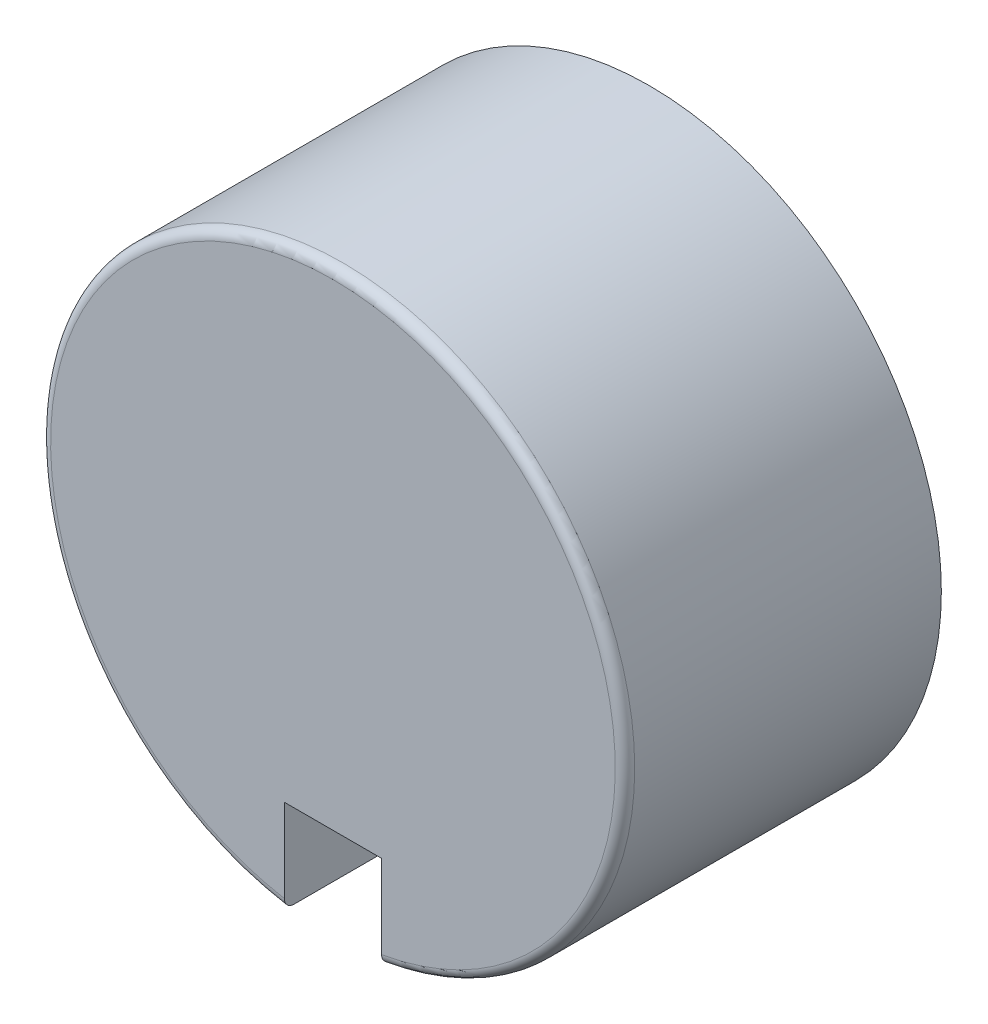
ISO-10303-21;
HEADER;
FILE_DESCRIPTION(('STEP AP214'),'2;1');
FILE_NAME('part.step','',(''),(''),'','','');
FILE_SCHEMA(('AUTOMOTIVE_DESIGN { 1 0 10303 214 1 1 1 1 }'));
ENDSEC;
DATA;
#1=APPLICATION_CONTEXT('core data for automotive mechanical design processes');
#2=APPLICATION_PROTOCOL_DEFINITION('international standard','automotive_design',2000,#1);
#3=PRODUCT_CONTEXT('',#1,'mechanical');
#4=PRODUCT('Part','Part','',(#3));
#5=PRODUCT_RELATED_PRODUCT_CATEGORY('part','',(#4));
#6=PRODUCT_DEFINITION_FORMATION('','',#4);
#7=PRODUCT_DEFINITION_CONTEXT('part definition',#1,'design');
#8=PRODUCT_DEFINITION('design','',#6,#7);
#9=PRODUCT_DEFINITION_SHAPE('','',#8);
#10=(LENGTH_UNIT() NAMED_UNIT(*) SI_UNIT(.MILLI.,.METRE.));
#11=(NAMED_UNIT(*) PLANE_ANGLE_UNIT() SI_UNIT($,.RADIAN.));
#12=(NAMED_UNIT(*) SI_UNIT($,.STERADIAN.) SOLID_ANGLE_UNIT());
#13=UNCERTAINTY_MEASURE_WITH_UNIT(LENGTH_MEASURE(1.E-05),#10,'distance_accuracy_value','');
#14=(GEOMETRIC_REPRESENTATION_CONTEXT(3) GLOBAL_UNCERTAINTY_ASSIGNED_CONTEXT((#13)) GLOBAL_UNIT_ASSIGNED_CONTEXT((#10,
#11,#12)) REPRESENTATION_CONTEXT('',''));
#15=CARTESIAN_POINT('',(0.,0.,0.));
#16=DIRECTION('',(0.,0.,1.));
#17=DIRECTION('',(1.,0.,0.));
#18=AXIS2_PLACEMENT_3D('',#15,#16,#17);
#19=CARTESIAN_POINT('',(0.,0.,-6.5));
#20=DIRECTION('',(0.,0.,1.));
#21=DIRECTION('',(1.,0.,0.));
#22=AXIS2_PLACEMENT_3D('',#19,#20,#21);
#23=CYLINDRICAL_SURFACE('',#22,4.9);
#24=CARTESIAN_POINT('',(0.,0.,-6.5));
#25=DIRECTION('',(0.,0.,1.));
#26=DIRECTION('',(1.,0.,0.));
#27=AXIS2_PLACEMENT_3D('',#24,#25,#26);
#28=CIRCLE('',#27,4.9);
#29=CARTESIAN_POINT('',(4.9,0.,-6.5));
#30=VERTEX_POINT('',#29);
#31=EDGE_CURVE('E135',#30,#30,#28,.T.);
#32=ORIENTED_EDGE('',*,*,#31,.F.);
#33=EDGE_LOOP('',(#32));
#34=FACE_BOUND('',#33,.T.);
#35=DIRECTION('',(0.,0.,1.));
#36=VECTOR('',#35,1.);
#37=CARTESIAN_POINT('',(1.,-4.79687398208458,-6.5));
#38=LINE('',#37,#36);
#39=CARTESIAN_POINT('',(1.,-4.79687398208458,-1.));
#40=VERTEX_POINT('',#39);
#41=CARTESIAN_POINT('',(1.,-4.79687398208458,-2.));
#42=VERTEX_POINT('',#41);
#43=EDGE_CURVE('E131',#40,#42,#38,.F.);
#44=ORIENTED_EDGE('',*,*,#43,.F.);
#45=CARTESIAN_POINT('',(0.,0.,-1.));
#46=DIRECTION('',(0.,0.,1.));
#47=DIRECTION('',(1.,0.,0.));
#48=AXIS2_PLACEMENT_3D('',#45,#46,#47);
#49=CIRCLE('',#48,4.9);
#50=CARTESIAN_POINT('',(-1.,-4.79687398208458,-1.));
#51=VERTEX_POINT('',#50);
#52=EDGE_CURVE('E141',#51,#40,#49,.F.);
#53=ORIENTED_EDGE('',*,*,#52,.F.);
#54=DIRECTION('',(0.,0.,1.));
#55=VECTOR('',#54,1.);
#56=CARTESIAN_POINT('',(-1.,-4.79687398208458,-6.5));
#57=LINE('',#56,#55);
#58=CARTESIAN_POINT('',(-1.,-4.79687398208458,-2.));
#59=VERTEX_POINT('',#58);
#60=EDGE_CURVE('E124',#59,#51,#57,.T.);
#61=ORIENTED_EDGE('',*,*,#60,.F.);
#62=CARTESIAN_POINT('',(0.,0.,-2.));
#63=DIRECTION('',(0.,0.,1.));
#64=DIRECTION('',(1.,0.,0.));
#65=AXIS2_PLACEMENT_3D('',#62,#63,#64);
#66=CIRCLE('',#65,4.9);
#67=EDGE_CURVE('E133',#42,#59,#66,.F.);
#68=ORIENTED_EDGE('',*,*,#67,.F.);
#69=EDGE_LOOP('',(#44,#53,#61,#68));
#70=FACE_BOUND('',#69,.T.);
#71=ADVANCED_FACE('F35',(#34,#70),#23,.F.);
#72=CARTESIAN_POINT('',(0.,0.,-6.5));
#73=DIRECTION('',(0.,0.,1.));
#74=DIRECTION('',(1.,0.,0.));
#75=AXIS2_PLACEMENT_3D('',#72,#73,#74);
#76=CYLINDRICAL_SURFACE('',#75,6.);
#77=CARTESIAN_POINT('',(0.,0.,-6.5));
#78=DIRECTION('',(0.,0.,1.));
#79=DIRECTION('',(1.,0.,0.));
#80=AXIS2_PLACEMENT_3D('',#77,#78,#79);
#81=CIRCLE('',#80,6.);
#82=CARTESIAN_POINT('',(6.,0.,-6.5));
#83=VERTEX_POINT('',#82);
#84=EDGE_CURVE('E138',#83,#83,#81,.T.);
#85=ORIENTED_EDGE('',*,*,#84,.T.);
#86=EDGE_LOOP('',(#85));
#87=FACE_BOUND('',#86,.T.);
#88=CARTESIAN_POINT('',(0.,0.,-0.2));
#89=DIRECTION('',(0.,0.,1.));
#90=DIRECTION('',(1.,0.,0.));
#91=AXIS2_PLACEMENT_3D('',#88,#89,#90);
#92=CIRCLE('',#91,6.);
#93=CARTESIAN_POINT('',(-1.,-5.9160797831018,-0.200000000000269));
#94=VERTEX_POINT('',#93);
#95=CARTESIAN_POINT('',(1.,-5.91607978309985,-0.199999999999976));
#96=VERTEX_POINT('',#95);
#97=EDGE_CURVE('E145',#94,#96,#92,.F.);
#98=ORIENTED_EDGE('',*,*,#97,.T.);
#99=DIRECTION('',(0.,0.,1.));
#100=VECTOR('',#99,1.);
#101=CARTESIAN_POINT('',(1.,-5.91607978309962,-6.5));
#102=LINE('',#101,#100);
#103=CARTESIAN_POINT('',(1.,-5.91607978309962,-2.));
#104=VERTEX_POINT('',#103);
#105=EDGE_CURVE('E126',#96,#104,#102,.F.);
#106=ORIENTED_EDGE('',*,*,#105,.T.);
#107=CARTESIAN_POINT('',(0.,0.,-2.));
#108=DIRECTION('',(0.,0.,1.));
#109=DIRECTION('',(1.,0.,0.));
#110=AXIS2_PLACEMENT_3D('',#107,#108,#109);
#111=CIRCLE('',#110,6.);
#112=CARTESIAN_POINT('',(-1.,-5.91607978309962,-2.));
#113=VERTEX_POINT('',#112);
#114=EDGE_CURVE('E11',#104,#113,#111,.F.);
#115=ORIENTED_EDGE('',*,*,#114,.T.);
#116=DIRECTION('',(0.,0.,1.));
#117=VECTOR('',#116,1.);
#118=CARTESIAN_POINT('',(-1.,-5.91607978309962,-6.5));
#119=LINE('',#118,#117);
#120=EDGE_CURVE('E120',#113,#94,#119,.T.);
#121=ORIENTED_EDGE('',*,*,#120,.T.);
#122=EDGE_LOOP('',(#98,#106,#115,#121));
#123=FACE_BOUND('',#122,.T.);
#124=ADVANCED_FACE('F176',(#87,#123),#76,.T.);
#125=CARTESIAN_POINT('',(0.,0.,0.));
#126=DIRECTION('',(0.,0.,1.));
#127=DIRECTION('',(1.,0.,0.));
#128=AXIS2_PLACEMENT_3D('',#125,#126,#127);
#129=PLANE('',#128);
#130=DIRECTION('',(1.,0.,0.));
#131=VECTOR('',#130,1.);
#132=CARTESIAN_POINT('',(-1.,-4.,0.));
#133=LINE('',#132,#131);
#134=CARTESIAN_POINT('',(-1.,-4.,0.));
#135=VERTEX_POINT('',#134);
#136=CARTESIAN_POINT('',(1.,-4.,0.));
#137=VERTEX_POINT('',#136);
#138=EDGE_CURVE('E96',#135,#137,#133,.T.);
#139=ORIENTED_EDGE('',*,*,#138,.T.);
#140=DIRECTION('',(0.,-1.,0.));
#141=VECTOR('',#140,1.);
#142=CARTESIAN_POINT('',(1.,-4.,0.));
#143=LINE('',#142,#141);
#144=CARTESIAN_POINT('',(1.,-5.71314274283428,0.));
#145=VERTEX_POINT('',#144);
#146=EDGE_CURVE('E105',#137,#145,#143,.T.);
#147=ORIENTED_EDGE('',*,*,#146,.T.);
#148=CARTESIAN_POINT('',(0.,0.,0.));
#149=DIRECTION('',(0.,0.,1.));
#150=DIRECTION('',(1.,0.,0.));
#151=AXIS2_PLACEMENT_3D('',#148,#149,#150);
#152=CIRCLE('',#151,5.8);
#153=CARTESIAN_POINT('',(-1.,-5.71314274283428,0.));
#154=VERTEX_POINT('',#153);
#155=EDGE_CURVE('E110',#145,#154,#152,.T.);
#156=ORIENTED_EDGE('',*,*,#155,.T.);
#157=DIRECTION('',(0.,-1.,0.));
#158=VECTOR('',#157,1.);
#159=CARTESIAN_POINT('',(-1.,-4.,0.));
#160=LINE('',#159,#158);
#161=EDGE_CURVE('E58',#135,#154,#160,.T.);
#162=ORIENTED_EDGE('',*,*,#161,.F.);
#163=EDGE_LOOP('',(#139,#147,#156,#162));
#164=FACE_BOUND('',#163,.T.);
#165=ADVANCED_FACE('F108',(#164),#129,.T.);
#166=CARTESIAN_POINT('',(0.,0.,-1.));
#167=DIRECTION('',(0.,0.,1.));
#168=DIRECTION('',(1.,0.,0.));
#169=AXIS2_PLACEMENT_3D('',#166,#167,#168);
#170=PLANE('',#169);
#171=DIRECTION('',(0.,-1.,0.));
#172=VECTOR('',#171,1.);
#173=CARTESIAN_POINT('',(1.,0.,-1.));
#174=LINE('',#173,#172);
#175=CARTESIAN_POINT('',(1.,-4.,-1.));
#176=VERTEX_POINT('',#175);
#177=EDGE_CURVE('E129',#176,#40,#174,.T.);
#178=ORIENTED_EDGE('',*,*,#177,.F.);
#179=DIRECTION('',(1.,0.,0.));
#180=VECTOR('',#179,1.);
#181=CARTESIAN_POINT('',(0.,-4.,-1.));
#182=LINE('',#181,#180);
#183=CARTESIAN_POINT('',(-1.,-4.,-1.));
#184=VERTEX_POINT('',#183);
#185=EDGE_CURVE('E44',#184,#176,#182,.T.);
#186=ORIENTED_EDGE('',*,*,#185,.F.);
#187=DIRECTION('',(0.,1.,0.));
#188=VECTOR('',#187,1.);
#189=CARTESIAN_POINT('',(-1.,0.,-1.));
#190=LINE('',#189,#188);
#191=EDGE_CURVE('E94',#51,#184,#190,.T.);
#192=ORIENTED_EDGE('',*,*,#191,.F.);
#193=ORIENTED_EDGE('',*,*,#52,.T.);
#194=EDGE_LOOP('',(#178,#186,#192,#193));
#195=FACE_BOUND('',#194,.T.);
#196=ADVANCED_FACE('F170',(#195),#170,.F.);
#197=CARTESIAN_POINT('',(0.,0.,-0.2));
#198=DIRECTION('',(0.,0.,1.));
#199=DIRECTION('',(1.,0.,0.));
#200=AXIS2_PLACEMENT_3D('',#197,#198,#199);
#201=TOROIDAL_SURFACE('',#200,5.8,0.2);
#202=ORIENTED_EDGE('',*,*,#155,.F.);
#203=CARTESIAN_POINT('',(1.,-5.8982449608597,-0.117996134023775));
#204=CARTESIAN_POINT('',(1.,-5.90284940246298,-0.12809564819195));
#205=CARTESIAN_POINT('',(1.,-5.90660825895747,-0.138589034521386));
#206=CARTESIAN_POINT('',(1.,-5.91231453909085,-0.160066001184723));
#207=CARTESIAN_POINT('',(1.,-5.91425999612147,-0.171050100198483));
#208=CARTESIAN_POINT('',(1.,-5.91627488954328,-0.193186837419315));
#209=CARTESIAN_POINT('',(1.,-5.91634488073243,-0.204339424807556));
#210=CARTESIAN_POINT('',(1.,-5.91460761355215,-0.226494538112982));
#211=CARTESIAN_POINT('',(1.,-5.91280077872359,-0.237497097319273));
#212=CARTESIAN_POINT('',(1.,-5.90737048505053,-0.25902566855835));
#213=CARTESIAN_POINT('',(1.,-5.90374988030742,-0.269552401055242));
#214=CARTESIAN_POINT('',(1.,-5.8948028473437,-0.289854070379176));
#215=CARTESIAN_POINT('',(1.,-5.88947633051022,-0.299628968119763));
#216=CARTESIAN_POINT('',(1.,-5.87723904776974,-0.318214463897688));
#217=CARTESIAN_POINT('',(1.,-5.87031901661267,-0.327018958723426));
#218=CARTESIAN_POINT('',(1.,-5.85511550567612,-0.343358868608756));
#219=CARTESIAN_POINT('',(1.,-5.84683194919554,-0.350894212227716));
#220=CARTESIAN_POINT('',(1.,-5.82902848902292,-0.364582449759333));
#221=CARTESIAN_POINT('',(1.,-5.81949459689243,-0.370717146980239));
#222=CARTESIAN_POINT('',(1.,-5.79954326159245,-0.381324296499617));
#223=CARTESIAN_POINT('',(1.,-5.78912575427127,-0.38579662798095));
#224=CARTESIAN_POINT('',(1.,-5.76754828341185,-0.393015594430471));
#225=CARTESIAN_POINT('',(1.,-5.75638003824898,-0.395737483163669));
#226=CARTESIAN_POINT('',(1.,-5.73374638718978,-0.3992876254919));
#227=CARTESIAN_POINT('',(1.,-5.7222809623604,-0.400115758136016));
#228=CARTESIAN_POINT('',(1.,-5.69926056860509,-0.399856960695239));
#229=CARTESIAN_POINT('',(1.,-5.68770580406378,-0.398751461473628));
#230=CARTESIAN_POINT('',(1.,-5.66494482650492,-0.39461872312261));
#231=CARTESIAN_POINT('',(1.,-5.65373862127352,-0.39159144109645));
#232=CARTESIAN_POINT('',(1.,-5.63198386193382,-0.383690415886474));
#233=CARTESIAN_POINT('',(1.,-5.62143597888692,-0.378814823304399));
#234=CARTESIAN_POINT('',(1.,-5.60131816527423,-0.367347087084138));
#235=CARTESIAN_POINT('',(1.,-5.59174820081033,-0.360755002973746));
#236=CARTESIAN_POINT('',(1.,-5.57395099927192,-0.346098468347493));
#237=CARTESIAN_POINT('',(1.,-5.5657127847031,-0.338047353523434));
#238=CARTESIAN_POINT('',(1.,-5.55072994054039,-0.320657851251012));
#239=CARTESIAN_POINT('',(1.,-5.54398518875856,-0.311319569213976));
#240=CARTESIAN_POINT('',(1.,-5.5322888661944,-0.291769794832765));
#241=CARTESIAN_POINT('',(1.,-5.52731202659611,-0.281573421112068));
#242=CARTESIAN_POINT('',(1.,-5.51916912367977,-0.260481584622246));
#243=CARTESIAN_POINT('',(1.,-5.51600290020523,-0.24958618377981));
#244=CARTESIAN_POINT('',(1.,-5.51161382922065,-0.227572016000385));
#245=CARTESIAN_POINT('',(1.,-5.51036402008469,-0.216458618996264));
#246=CARTESIAN_POINT('',(1.,-5.50976166416355,-0.194180788619046));
#247=CARTESIAN_POINT('',(1.,-5.51040902107902,-0.183016357865123));
#248=CARTESIAN_POINT('',(1.,-5.51356981225732,-0.161030558335853));
#249=CARTESIAN_POINT('',(1.,-5.51607092083278,-0.150207413619104));
#250=CARTESIAN_POINT('',(1.,-5.52284746691649,-0.129132046164254));
#251=CARTESIAN_POINT('',(1.,-5.52712291926431,-0.118879828201859));
#252=CARTESIAN_POINT('',(1.,-5.53733948583266,-0.0991886888111274));
#253=CARTESIAN_POINT('',(1.,-5.54328740408271,-0.0897532999413653));
#254=CARTESIAN_POINT('',(1.,-5.55666417968717,-0.0719987645097891));
#255=CARTESIAN_POINT('',(1.,-5.5640931215594,-0.0636796816977534));
#256=CARTESIAN_POINT('',(1.,-5.58032012716,-0.0482790052782423));
#257=CARTESIAN_POINT('',(1.,-5.58913440453007,-0.0412144990421068));
#258=CARTESIAN_POINT('',(1.,-5.60780888445044,-0.0286389316031162));
#259=CARTESIAN_POINT('',(1.,-5.61766917347447,-0.0231279989720658));
#260=CARTESIAN_POINT('',(1.,-5.6383179728061,-0.0137284109082103));
#261=CARTESIAN_POINT('',(1.,-5.64911839242828,-0.00986591134086246));
#262=CARTESIAN_POINT('',(1.,-5.6712105202713,-0.00398649000902977));
#263=CARTESIAN_POINT('',(1.,-5.68250226307756,-0.00196969838927203));
#264=CARTESIAN_POINT('',(1.,-5.70539044516461,0.000178149193995465));
#265=CARTESIAN_POINT('',(1.,-5.71698887452675,0.000288053286869655));
#266=CARTESIAN_POINT('',(1.,-5.74004023306832,-0.00143613443673743));
#267=CARTESIAN_POINT('',(1.,-5.75149316386353,-0.00327020464600208));
#268=CARTESIAN_POINT('',(1.,-5.77395149316123,-0.00884153084814581));
#269=CARTESIAN_POINT('',(1.,-5.78495593933686,-0.0125826298544445));
#270=CARTESIAN_POINT('',(1.,-5.80617667568098,-0.0218738343380537));
#271=CARTESIAN_POINT('',(1.,-5.81639279173221,-0.0274243380494783));
#272=CARTESIAN_POINT('',(1.,-5.8356637965465,-0.0401389835754201));
#273=CARTESIAN_POINT('',(1.,-5.84472621164833,-0.0472917265971989));
#274=CARTESIAN_POINT('',(1.,-5.86149222902899,-0.0630310601201447));
#275=CARTESIAN_POINT('',(1.,-5.86919755910767,-0.0716157999162422));
#276=CARTESIAN_POINT('',(1.,-5.88045706271264,-0.086567152463729));
#277=CARTESIAN_POINT('',(1.,-5.88449188728168,-0.0925781099193626));
#278=CARTESIAN_POINT('',(1.,-5.89188578562603,-0.105002353808573));
#279=CARTESIAN_POINT('',(1.,-5.89524486468477,-0.111415637095976));
#280=CARTESIAN_POINT('',(1.,-5.8982449608597,-0.117996134023775));
#281=B_SPLINE_CURVE_WITH_KNOTS('',3,(#203,#204,#205,#206,#207,#208,#209,#210,#211,#212,#213,
#214,#215,#216,#217,#218,#219,#220,#221,#222,#223,#224,#225,#226,#227,#228,#229,#230,#231,#232,
#233,#234,#235,#236,#237,#238,#239,#240,#241,#242,#243,#244,#245,#246,#247,#248,#249,#250,#251,
#252,#253,#254,#255,#256,#257,#258,#259,#260,#261,#262,#263,#264,#265,#266,#267,#268,#269,#270,
#271,#272,#273,#274,#275,#276,#277,#278,#279,#280),.UNSPECIFIED.,.T.,.F.,(4,2,2,2,2,2,2,2,2,2,2,
2,2,2,2,2,2,2,2,2,2,2,2,2,2,2,2,2,2,2,2,2,2,2,2,2,2,2,4),(0.,0.0332725897718165,
0.0665812213977847,0.0998799995973357,0.133171264937165,0.166410307785302,0.199651077501586,
0.233090231766396,0.266531267695524,0.300384748808202,0.334240689837634,0.368565305821954,
0.402892113998742,0.437550383209348,0.472209426065908,0.506903240288814,0.541595851493114,
0.57598604355215,0.610373420930771,0.64424739342885,0.678118369170345,0.711508301682278,
0.744896539364481,0.778064746348603,0.811233230737557,0.844538655638697,0.877845981730508,
0.911576988372977,0.945310785732334,0.979561557187355,1.01381474354986,1.04844763842694,
1.08308014836446,1.11778272671227,1.15249294795581,1.18696365983532,1.22139016229572,
1.24306960975334,1.26474888769953),.UNSPECIFIED.);
#282=EDGE_CURVE('E153',#145,#96,#281,.T.);
#283=ORIENTED_EDGE('',*,*,#282,.T.);
#284=ORIENTED_EDGE('',*,*,#97,.F.);
#285=CARTESIAN_POINT('',(-1.,-5.8982449608597,-0.117996134023775));
#286=CARTESIAN_POINT('',(-1.,-5.89357112276656,-0.107746889499634));
#287=CARTESIAN_POINT('',(-1.,-5.8880193987563,-0.0978882896056384));
#288=CARTESIAN_POINT('',(-1.,-5.87532877831371,-0.0792395143415351));
#289=CARTESIAN_POINT('',(-1.,-5.86818777128844,-0.0704507840109065));
#290=CARTESIAN_POINT('',(-1.,-5.85254293453124,-0.0542015022902492));
#291=CARTESIAN_POINT('',(-1.,-5.84404055752965,-0.046739552796617));
#292=CARTESIAN_POINT('',(-1.,-5.82591750987947,-0.0333339911290358));
#293=CARTESIAN_POINT('',(-1.,-5.81629710775323,-0.0273900154669147));
#294=CARTESIAN_POINT('',(-1.,-5.79610383975728,-0.01711776036898));
#295=CARTESIAN_POINT('',(-1.,-5.78552215854018,-0.0128068122231284));
#296=CARTESIAN_POINT('',(-1.,-5.76379019887745,-0.00599813839470695));
#297=CARTESIAN_POINT('',(-1.,-5.75263985727142,-0.003500614598395));
#298=CARTESIAN_POINT('',(-1.,-5.72994186735187,-0.000362395286940027));
#299=CARTESIAN_POINT('',(-1.,-5.71839103149766,0.00025527495109669));
#300=CARTESIAN_POINT('',(-1.,-5.69534805627243,-0.000446230275118177));
#301=CARTESIAN_POINT('',(-1.,-5.68385591941737,-0.00176548807192294));
#302=CARTESIAN_POINT('',(-1.,-5.66119422406995,-0.0063182507117322));
#303=CARTESIAN_POINT('',(-1.,-5.65002666499399,-0.00956172234582936));
#304=CARTESIAN_POINT('',(-1.,-5.62839811787361,-0.0178857578196598));
#305=CARTESIAN_POINT('',(-1.,-5.61793712218812,-0.0229663017887231));
#306=CARTESIAN_POINT('',(-1.,-5.59807356013825,-0.0348016502097224));
#307=CARTESIAN_POINT('',(-1.,-5.58866638751007,-0.0415487191293525));
#308=CARTESIAN_POINT('',(-1.,-5.57113701102897,-0.0565454634651826));
#309=CARTESIAN_POINT('',(-1.,-5.56301472598227,-0.0647950438647397));
#310=CARTESIAN_POINT('',(-1.,-5.54840014323567,-0.0824508159142979));
#311=CARTESIAN_POINT('',(-1.,-5.54188819259497,-0.0918407359298977));
#312=CARTESIAN_POINT('',(-1.,-5.5305622894869,-0.111594296560577));
#313=CARTESIAN_POINT('',(-1.,-5.52574818076005,-0.121957847457116));
#314=CARTESIAN_POINT('',(-1.,-5.51803145234456,-0.143191923245072));
#315=CARTESIAN_POINT('',(-1.,-5.51510040332328,-0.154052120003079));
#316=CARTESIAN_POINT('',(-1.,-5.51112517357586,-0.1761123681227));
#317=CARTESIAN_POINT('',(-1.,-5.51008085759795,-0.187312395064819));
#318=CARTESIAN_POINT('',(-1.,-5.50991303203005,-0.209607060768767));
#319=CARTESIAN_POINT('',(-1.,-5.51076919305093,-0.220701552193179));
#320=CARTESIAN_POINT('',(-1.,-5.51433371106631,-0.242588527359295));
#321=CARTESIAN_POINT('',(-1.,-5.51704203352892,-0.25338101672765));
#322=CARTESIAN_POINT('',(-1.,-5.5242244393968,-0.274352728232757));
#323=CARTESIAN_POINT('',(-1.,-5.52869732862972,-0.284532359762745));
#324=CARTESIAN_POINT('',(-1.,-5.53927316225536,-0.304005915395452));
#325=CARTESIAN_POINT('',(-1.,-5.54537616933222,-0.313299805419447));
#326=CARTESIAN_POINT('',(-1.,-5.55909698043913,-0.330835149809045));
#327=CARTESIAN_POINT('',(-1.,-5.56672858797714,-0.339065799116375));
#328=CARTESIAN_POINT('',(-1.,-5.58324700103064,-0.35415237147629));
#329=CARTESIAN_POINT('',(-1.,-5.59213390032526,-0.361008191726794));
#330=CARTESIAN_POINT('',(-1.,-5.6110533910479,-0.373260206380079));
#331=CARTESIAN_POINT('',(-1.,-5.62110120479984,-0.378632894661616));
#332=CARTESIAN_POINT('',(-1.,-5.64194734931585,-0.387641508601613));
#333=CARTESIAN_POINT('',(-1.,-5.65274573923364,-0.391277297194941));
#334=CARTESIAN_POINT('',(-1.,-5.67494573567827,-0.396757042381295));
#335=CARTESIAN_POINT('',(-1.,-5.68635358825657,-0.398575714668591));
#336=CARTESIAN_POINT('',(-1.,-5.70931306950738,-0.400285701127198));
#337=CARTESIAN_POINT('',(-1.,-5.72086470496571,-0.400176923985435));
#338=CARTESIAN_POINT('',(-1.,-5.74386220574941,-0.398026600921754));
#339=CARTESIAN_POINT('',(-1.,-5.75530691218983,-0.39597262282119));
#340=CARTESIAN_POINT('',(-1.,-5.77768722700787,-0.38996611775933));
#341=CARTESIAN_POINT('',(-1.,-5.78862283609977,-0.386013593461822));
#342=CARTESIAN_POINT('',(-1.,-5.8096318667164,-0.376330235128328));
#343=CARTESIAN_POINT('',(-1.,-5.81970807588737,-0.370605453236535));
#344=CARTESIAN_POINT('',(-1.,-5.83874181362869,-0.357527105929546));
#345=CARTESIAN_POINT('',(-1.,-5.84769940119788,-0.350173626472631));
#346=CARTESIAN_POINT('',(-1.,-5.86413092374768,-0.334133512730541));
#347=CARTESIAN_POINT('',(-1.,-5.87162049929293,-0.325462904398704));
#348=CARTESIAN_POINT('',(-1.,-5.88501230016829,-0.306972359318924));
#349=CARTESIAN_POINT('',(-1.,-5.89091471587143,-0.29715256061441));
#350=CARTESIAN_POINT('',(-1.,-5.90087702581459,-0.276792649746738));
#351=CARTESIAN_POINT('',(-1.,-5.90496196994451,-0.266264791614187));
#352=CARTESIAN_POINT('',(-1.,-5.91128520258791,-0.244665226947994));
#353=CARTESIAN_POINT('',(-1.,-5.91352314633661,-0.233593419288122));
#354=CARTESIAN_POINT('',(-1.,-5.91606774810507,-0.211348621153549));
#355=CARTESIAN_POINT('',(-1.,-5.9163943183968,-0.200177892649831));
#356=CARTESIAN_POINT('',(-1.,-5.91515839019412,-0.177951169470223));
#357=CARTESIAN_POINT('',(-1.,-5.91359829193101,-0.166895047024611));
#358=CARTESIAN_POINT('',(-1.,-5.90962920244482,-0.149514868471999));
#359=CARTESIAN_POINT('',(-1.,-5.90780185145101,-0.143052295170092));
#360=CARTESIAN_POINT('',(-1.,-5.9035018246895,-0.130345652959682));
#361=CARTESIAN_POINT('',(-1.,-5.9010291540492,-0.124101582315503));
#362=CARTESIAN_POINT('',(-1.,-5.8982449608597,-0.117996134023775));
#363=B_SPLINE_CURVE_WITH_KNOTS('',3,(#285,#286,#287,#288,#289,#290,#291,#292,#293,#294,#295,
#296,#297,#298,#299,#300,#301,#302,#303,#304,#305,#306,#307,#308,#309,#310,#311,#312,#313,#314,
#315,#316,#317,#318,#319,#320,#321,#322,#323,#324,#325,#326,#327,#328,#329,#330,#331,#332,#333,
#334,#335,#336,#337,#338,#339,#340,#341,#342,#343,#344,#345,#346,#347,#348,#349,#350,#351,#352,
#353,#354,#355,#356,#357,#358,#359,#360,#361,#362),.UNSPECIFIED.,.T.,.F.,(4,2,2,2,2,2,2,2,2,2,2,
2,2,2,2,2,2,2,2,2,2,2,2,2,2,2,2,2,2,2,2,2,2,2,2,2,2,2,4),(0.,0.0337689702729319,
0.0675830567458028,0.101361297473949,0.135131442194417,0.169250566012189,0.203373487687052,
0.237912713287962,0.272453407082274,0.307174591756376,0.34189540088045,0.37645797873229,
0.41101837165534,0.44513347722605,0.479245442221641,0.512829487756993,0.546411125700971,
0.57963527396945,0.612858802820577,0.646059886079329,0.679262246227732,0.71277916808122,
0.746298595210229,0.780322205852671,0.81434850097985,0.84884192424359,0.883336981640443,
0.918054002513755,0.952770974676883,0.987370674598653,1.02196854887617,1.05617495175514,
1.09037724989059,1.12409231810898,1.15781367822677,1.19118310239086,1.22451011839215,
1.24462636593747,1.26474245365308),.UNSPECIFIED.);
#364=EDGE_CURVE('E148',#94,#154,#363,.T.);
#365=ORIENTED_EDGE('',*,*,#364,.T.);
#366=EDGE_LOOP('',(#202,#283,#284,#365));
#367=FACE_BOUND('',#366,.T.);
#368=ADVANCED_FACE('F37',(#367),#201,.T.);
#369=CARTESIAN_POINT('',(0.,0.,-6.5));
#370=DIRECTION('',(0.,0.,1.));
#371=DIRECTION('',(1.,0.,0.));
#372=AXIS2_PLACEMENT_3D('',#369,#370,#371);
#373=PLANE('',#372);
#374=ORIENTED_EDGE('',*,*,#31,.T.);
#375=EDGE_LOOP('',(#374));
#376=FACE_BOUND('',#375,.T.);
#377=ORIENTED_EDGE('',*,*,#84,.F.);
#378=EDGE_LOOP('',(#377));
#379=FACE_BOUND('',#378,.T.);
#380=ADVANCED_FACE('F164',(#376,#379),#373,.F.);
#381=CARTESIAN_POINT('',(-1.,-4.,-2.));
#382=DIRECTION('',(0.,0.,1.));
#383=DIRECTION('',(1.,0.,0.));
#384=AXIS2_PLACEMENT_3D('',#381,#382,#383);
#385=PLANE('',#384);
#386=ORIENTED_EDGE('',*,*,#67,.T.);
#387=DIRECTION('',(0.,-1.,0.));
#388=VECTOR('',#387,1.);
#389=CARTESIAN_POINT('',(-1.,-4.,-2.));
#390=LINE('',#389,#388);
#391=EDGE_CURVE('E111',#59,#113,#390,.T.);
#392=ORIENTED_EDGE('',*,*,#391,.T.);
#393=ORIENTED_EDGE('',*,*,#114,.F.);
#394=DIRECTION('',(0.,-1.,0.));
#395=VECTOR('',#394,1.);
#396=CARTESIAN_POINT('',(1.,-4.,-2.));
#397=LINE('',#396,#395);
#398=EDGE_CURVE('E114',#42,#104,#397,.T.);
#399=ORIENTED_EDGE('',*,*,#398,.F.);
#400=EDGE_LOOP('',(#386,#392,#393,#399));
#401=FACE_BOUND('',#400,.T.);
#402=ADVANCED_FACE('F162',(#401),#385,.T.);
#403=CARTESIAN_POINT('',(0.,-4.,0.));
#404=DIRECTION('',(0.,-1.,0.));
#405=DIRECTION('',(0.,0.,-1.));
#406=AXIS2_PLACEMENT_3D('',#403,#404,#405);
#407=PLANE('',#406);
#408=ORIENTED_EDGE('',*,*,#185,.T.);
#409=DIRECTION('',(0.,0.,-1.));
#410=VECTOR('',#409,1.);
#411=CARTESIAN_POINT('',(1.,-4.,0.));
#412=LINE('',#411,#410);
#413=EDGE_CURVE('E97',#137,#176,#412,.T.);
#414=ORIENTED_EDGE('',*,*,#413,.F.);
#415=ORIENTED_EDGE('',*,*,#138,.F.);
#416=DIRECTION('',(0.,0.,1.));
#417=VECTOR('',#416,1.);
#418=CARTESIAN_POINT('',(-1.,-4.,0.));
#419=LINE('',#418,#417);
#420=EDGE_CURVE('E51',#184,#135,#419,.T.);
#421=ORIENTED_EDGE('',*,*,#420,.F.);
#422=EDGE_LOOP('',(#408,#414,#415,#421));
#423=FACE_BOUND('',#422,.T.);
#424=ADVANCED_FACE('F101',(#423),#407,.T.);
#425=CARTESIAN_POINT('',(1.,-4.,0.));
#426=DIRECTION('',(-1.,0.,0.));
#427=DIRECTION('',(0.,0.,1.));
#428=AXIS2_PLACEMENT_3D('',#425,#426,#427);
#429=PLANE('',#428);
#430=ORIENTED_EDGE('',*,*,#43,.T.);
#431=ORIENTED_EDGE('',*,*,#398,.T.);
#432=ORIENTED_EDGE('',*,*,#105,.F.);
#433=ORIENTED_EDGE('',*,*,#282,.F.);
#434=ORIENTED_EDGE('',*,*,#146,.F.);
#435=ORIENTED_EDGE('',*,*,#413,.T.);
#436=ORIENTED_EDGE('',*,*,#177,.T.);
#437=EDGE_LOOP('',(#430,#431,#432,#433,#434,#435,#436));
#438=FACE_BOUND('',#437,.T.);
#439=ADVANCED_FACE('F161',(#438),#429,.T.);
#440=CARTESIAN_POINT('',(-1.,-4.,0.));
#441=DIRECTION('',(1.,0.,0.));
#442=DIRECTION('',(0.,0.,-1.));
#443=AXIS2_PLACEMENT_3D('',#440,#441,#442);
#444=PLANE('',#443);
#445=ORIENTED_EDGE('',*,*,#60,.T.);
#446=ORIENTED_EDGE('',*,*,#191,.T.);
#447=ORIENTED_EDGE('',*,*,#420,.T.);
#448=ORIENTED_EDGE('',*,*,#161,.T.);
#449=ORIENTED_EDGE('',*,*,#364,.F.);
#450=ORIENTED_EDGE('',*,*,#120,.F.);
#451=ORIENTED_EDGE('',*,*,#391,.F.);
#452=EDGE_LOOP('',(#445,#446,#447,#448,#449,#450,#451));
#453=FACE_BOUND('',#452,.T.);
#454=ADVANCED_FACE('F92',(#453),#444,.T.);
#455=CLOSED_SHELL('',(#71,#124,#165,#196,#368,#380,#402,#424,#439,#454));
#456=MANIFOLD_SOLID_BREP('B2',#455);
#457=ADVANCED_BREP_SHAPE_REPRESENTATION('',(#18,#456),#14);
#458=SHAPE_DEFINITION_REPRESENTATION(#9,#457);
ENDSEC;
END-ISO-10303-21;
